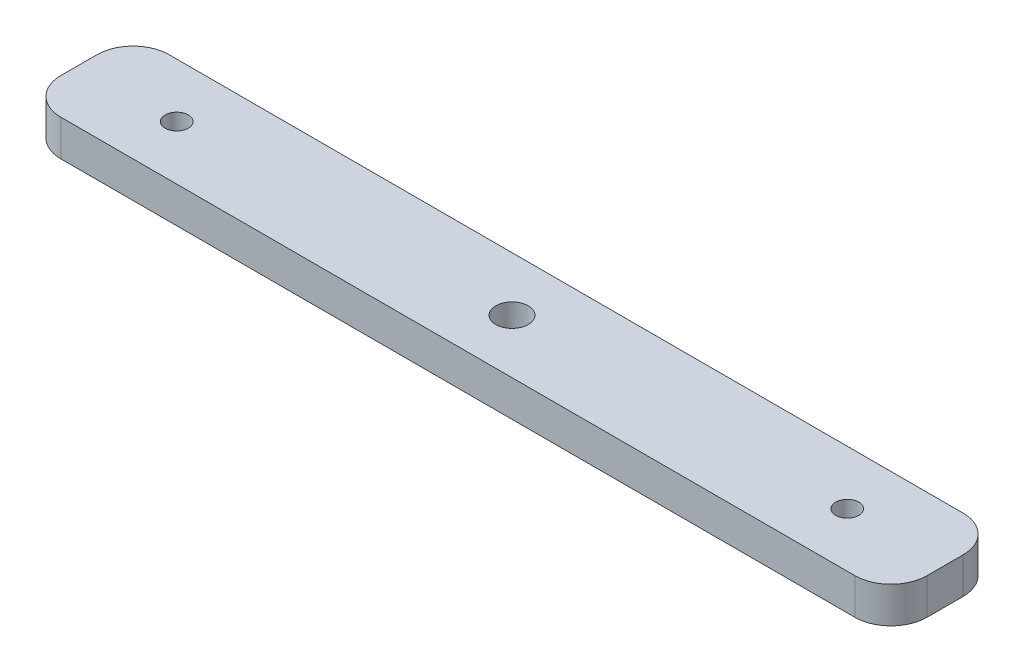
ISO-10303-21;
HEADER;
FILE_DESCRIPTION(('STEP AP214'),'2;1');
FILE_NAME('part.step','',(''),(''),'','','');
FILE_SCHEMA(('AUTOMOTIVE_DESIGN { 1 0 10303 214 1 1 1 1 }'));
ENDSEC;
DATA;
#1=APPLICATION_CONTEXT('core data for automotive mechanical design processes');
#2=APPLICATION_PROTOCOL_DEFINITION('international standard','automotive_design',2000,#1);
#3=PRODUCT_CONTEXT('',#1,'mechanical');
#4=PRODUCT('Part','Part','',(#3));
#5=PRODUCT_RELATED_PRODUCT_CATEGORY('part','',(#4));
#6=PRODUCT_DEFINITION_FORMATION('','',#4);
#7=PRODUCT_DEFINITION_CONTEXT('part definition',#1,'design');
#8=PRODUCT_DEFINITION('design','',#6,#7);
#9=PRODUCT_DEFINITION_SHAPE('','',#8);
#10=(LENGTH_UNIT() NAMED_UNIT(*) SI_UNIT(.MILLI.,.METRE.));
#11=(NAMED_UNIT(*) PLANE_ANGLE_UNIT() SI_UNIT($,.RADIAN.));
#12=(NAMED_UNIT(*) SI_UNIT($,.STERADIAN.) SOLID_ANGLE_UNIT());
#13=UNCERTAINTY_MEASURE_WITH_UNIT(LENGTH_MEASURE(1.E-05),#10,'distance_accuracy_value','');
#14=(GEOMETRIC_REPRESENTATION_CONTEXT(3) GLOBAL_UNCERTAINTY_ASSIGNED_CONTEXT((#13)) GLOBAL_UNIT_ASSIGNED_CONTEXT((#10,
#11,#12)) REPRESENTATION_CONTEXT('',''));
#15=CARTESIAN_POINT('',(0.,0.,0.));
#16=DIRECTION('',(0.,0.,1.));
#17=DIRECTION('',(1.,0.,0.));
#18=AXIS2_PLACEMENT_3D('',#15,#16,#17);
#19=CARTESIAN_POINT('',(0.,5.,0.));
#20=DIRECTION('',(1.,0.,0.));
#21=DIRECTION('',(0.,0.,-1.));
#22=AXIS2_PLACEMENT_3D('',#19,#20,#21);
#23=PLANE('',#22);
#24=DIRECTION('',(0.,0.,1.));
#25=VECTOR('',#24,1.);
#26=CARTESIAN_POINT('',(0.,5.,0.));
#27=LINE('',#26,#25);
#28=CARTESIAN_POINT('',(0.,5.,-10.));
#29=VERTEX_POINT('',#28);
#30=CARTESIAN_POINT('',(0.,5.,-5.));
#31=VERTEX_POINT('',#30);
#32=EDGE_CURVE('E120',#29,#31,#27,.T.);
#33=ORIENTED_EDGE('',*,*,#32,.F.);
#34=DIRECTION('',(0.,-1.,0.));
#35=VECTOR('',#34,1.);
#36=CARTESIAN_POINT('',(0.,5.,-10.));
#37=LINE('',#36,#35);
#38=CARTESIAN_POINT('',(0.,0.,-10.));
#39=VERTEX_POINT('',#38);
#40=EDGE_CURVE('E105',#29,#39,#37,.T.);
#41=ORIENTED_EDGE('',*,*,#40,.T.);
#42=DIRECTION('',(0.,0.,1.));
#43=VECTOR('',#42,1.);
#44=CARTESIAN_POINT('',(0.,0.,0.));
#45=LINE('',#44,#43);
#46=CARTESIAN_POINT('',(0.,0.,-5.));
#47=VERTEX_POINT('',#46);
#48=EDGE_CURVE('E117',#39,#47,#45,.T.);
#49=ORIENTED_EDGE('',*,*,#48,.T.);
#50=DIRECTION('',(0.,-1.,0.));
#51=VECTOR('',#50,1.);
#52=CARTESIAN_POINT('',(0.,5.,-5.));
#53=LINE('',#52,#51);
#54=EDGE_CURVE('E122',#47,#31,#53,.F.);
#55=ORIENTED_EDGE('',*,*,#54,.T.);
#56=EDGE_LOOP('',(#33,#41,#49,#55));
#57=FACE_BOUND('',#56,.T.);
#58=ADVANCED_FACE('F36',(#57),#23,.F.);
#59=CARTESIAN_POINT('',(0.,5.,0.));
#60=DIRECTION('',(0.,0.,-1.));
#61=DIRECTION('',(-1.,0.,0.));
#62=AXIS2_PLACEMENT_3D('',#59,#60,#61);
#63=PLANE('',#62);
#64=DIRECTION('',(1.,0.,0.));
#65=VECTOR('',#64,1.);
#66=CARTESIAN_POINT('',(0.,5.,0.));
#67=LINE('',#66,#65);
#68=CARTESIAN_POINT('',(5.,5.,0.));
#69=VERTEX_POINT('',#68);
#70=CARTESIAN_POINT('',(115.,5.,0.));
#71=VERTEX_POINT('',#70);
#72=EDGE_CURVE('E175',#69,#71,#67,.T.);
#73=ORIENTED_EDGE('',*,*,#72,.F.);
#74=DIRECTION('',(0.,-1.,0.));
#75=VECTOR('',#74,1.);
#76=CARTESIAN_POINT('',(5.,5.,0.));
#77=LINE('',#76,#75);
#78=CARTESIAN_POINT('',(5.,0.,0.));
#79=VERTEX_POINT('',#78);
#80=EDGE_CURVE('E159',#69,#79,#77,.T.);
#81=ORIENTED_EDGE('',*,*,#80,.T.);
#82=DIRECTION('',(1.,0.,0.));
#83=VECTOR('',#82,1.);
#84=CARTESIAN_POINT('',(0.,0.,0.));
#85=LINE('',#84,#83);
#86=CARTESIAN_POINT('',(115.,0.,0.));
#87=VERTEX_POINT('',#86);
#88=EDGE_CURVE('E126',#79,#87,#85,.T.);
#89=ORIENTED_EDGE('',*,*,#88,.T.);
#90=DIRECTION('',(0.,-1.,0.));
#91=VECTOR('',#90,1.);
#92=CARTESIAN_POINT('',(115.,5.,0.));
#93=LINE('',#92,#91);
#94=EDGE_CURVE('E157',#87,#71,#93,.F.);
#95=ORIENTED_EDGE('',*,*,#94,.T.);
#96=EDGE_LOOP('',(#73,#81,#89,#95));
#97=FACE_BOUND('',#96,.T.);
#98=ADVANCED_FACE('F224',(#97),#63,.F.);
#99=CARTESIAN_POINT('',(120.,5.,0.));
#100=DIRECTION('',(-1.,0.,0.));
#101=DIRECTION('',(0.,0.,1.));
#102=AXIS2_PLACEMENT_3D('',#99,#100,#101);
#103=PLANE('',#102);
#104=DIRECTION('',(0.,0.,-1.));
#105=VECTOR('',#104,1.);
#106=CARTESIAN_POINT('',(120.,0.,0.));
#107=LINE('',#106,#105);
#108=CARTESIAN_POINT('',(120.,0.,-5.));
#109=VERTEX_POINT('',#108);
#110=CARTESIAN_POINT('',(120.,0.,-10.));
#111=VERTEX_POINT('',#110);
#112=EDGE_CURVE('E130',#109,#111,#107,.T.);
#113=ORIENTED_EDGE('',*,*,#112,.T.);
#114=DIRECTION('',(0.,-1.,0.));
#115=VECTOR('',#114,1.);
#116=CARTESIAN_POINT('',(120.,5.,-10.));
#117=LINE('',#116,#115);
#118=CARTESIAN_POINT('',(120.,5.,-10.));
#119=VERTEX_POINT('',#118);
#120=EDGE_CURVE('E11',#111,#119,#117,.F.);
#121=ORIENTED_EDGE('',*,*,#120,.T.);
#122=DIRECTION('',(0.,0.,-1.));
#123=VECTOR('',#122,1.);
#124=CARTESIAN_POINT('',(120.,5.,0.));
#125=LINE('',#124,#123);
#126=CARTESIAN_POINT('',(120.,5.,-5.));
#127=VERTEX_POINT('',#126);
#128=EDGE_CURVE('E165',#127,#119,#125,.T.);
#129=ORIENTED_EDGE('',*,*,#128,.F.);
#130=DIRECTION('',(0.,-1.,0.));
#131=VECTOR('',#130,1.);
#132=CARTESIAN_POINT('',(120.,5.,-5.));
#133=LINE('',#132,#131);
#134=EDGE_CURVE('E44',#127,#109,#133,.T.);
#135=ORIENTED_EDGE('',*,*,#134,.T.);
#136=EDGE_LOOP('',(#113,#121,#129,#135));
#137=FACE_BOUND('',#136,.T.);
#138=ADVANCED_FACE('F164',(#137),#103,.F.);
#139=CARTESIAN_POINT('',(0.,5.,-15.));
#140=DIRECTION('',(0.,0.,1.));
#141=DIRECTION('',(1.,0.,0.));
#142=AXIS2_PLACEMENT_3D('',#139,#140,#141);
#143=PLANE('',#142);
#144=DIRECTION('',(-1.,0.,0.));
#145=VECTOR('',#144,1.);
#146=CARTESIAN_POINT('',(0.,0.,-15.));
#147=LINE('',#146,#145);
#148=CARTESIAN_POINT('',(115.,0.,-15.));
#149=VERTEX_POINT('',#148);
#150=CARTESIAN_POINT('',(5.,0.,-15.));
#151=VERTEX_POINT('',#150);
#152=EDGE_CURVE('E140',#149,#151,#147,.T.);
#153=ORIENTED_EDGE('',*,*,#152,.T.);
#154=DIRECTION('',(0.,-1.,0.));
#155=VECTOR('',#154,1.);
#156=CARTESIAN_POINT('',(5.,5.,-15.));
#157=LINE('',#156,#155);
#158=CARTESIAN_POINT('',(5.,5.,-15.));
#159=VERTEX_POINT('',#158);
#160=EDGE_CURVE('E106',#151,#159,#157,.F.);
#161=ORIENTED_EDGE('',*,*,#160,.T.);
#162=DIRECTION('',(-1.,0.,0.));
#163=VECTOR('',#162,1.);
#164=CARTESIAN_POINT('',(0.,5.,-15.));
#165=LINE('',#164,#163);
#166=CARTESIAN_POINT('',(115.,5.,-15.));
#167=VERTEX_POINT('',#166);
#168=EDGE_CURVE('E136',#167,#159,#165,.T.);
#169=ORIENTED_EDGE('',*,*,#168,.F.);
#170=DIRECTION('',(0.,-1.,0.));
#171=VECTOR('',#170,1.);
#172=CARTESIAN_POINT('',(115.,5.,-15.));
#173=LINE('',#172,#171);
#174=EDGE_CURVE('E111',#167,#149,#173,.T.);
#175=ORIENTED_EDGE('',*,*,#174,.T.);
#176=EDGE_LOOP('',(#153,#161,#169,#175));
#177=FACE_BOUND('',#176,.T.);
#178=ADVANCED_FACE('F173',(#177),#143,.F.);
#179=CARTESIAN_POINT('',(0.,5.,0.));
#180=DIRECTION('',(0.,-1.,0.));
#181=DIRECTION('',(0.,0.,-1.));
#182=AXIS2_PLACEMENT_3D('',#179,#180,#181);
#183=PLANE('',#182);
#184=CARTESIAN_POINT('',(60.,5.,-7.5));
#185=DIRECTION('',(0.,1.,0.));
#186=DIRECTION('',(0.,0.,1.));
#187=AXIS2_PLACEMENT_3D('',#184,#185,#186);
#188=CIRCLE('',#187,2.25);
#189=CARTESIAN_POINT('',(60.,5.,-5.25));
#190=VERTEX_POINT('',#189);
#191=EDGE_CURVE('E188',#190,#190,#188,.T.);
#192=ORIENTED_EDGE('',*,*,#191,.F.);
#193=EDGE_LOOP('',(#192));
#194=FACE_BOUND('',#193,.T.);
#195=CARTESIAN_POINT('',(106.45,5.,-7.50000000000002));
#196=DIRECTION('',(0.,1.,0.));
#197=DIRECTION('',(0.,0.,1.));
#198=AXIS2_PLACEMENT_3D('',#195,#196,#197);
#199=CIRCLE('',#198,1.6);
#200=CARTESIAN_POINT('',(106.45,5.,-5.90000000000001));
#201=VERTEX_POINT('',#200);
#202=EDGE_CURVE('E182',#201,#201,#199,.T.);
#203=ORIENTED_EDGE('',*,*,#202,.F.);
#204=EDGE_LOOP('',(#203));
#205=FACE_BOUND('',#204,.T.);
#206=CARTESIAN_POINT('',(13.55,5.,-7.5));
#207=DIRECTION('',(0.,1.,0.));
#208=DIRECTION('',(0.,0.,1.));
#209=AXIS2_PLACEMENT_3D('',#206,#207,#208);
#210=CIRCLE('',#209,1.6);
#211=CARTESIAN_POINT('',(13.55,5.,-5.9));
#212=VERTEX_POINT('',#211);
#213=EDGE_CURVE('E133',#212,#212,#210,.T.);
#214=ORIENTED_EDGE('',*,*,#213,.F.);
#215=EDGE_LOOP('',(#214));
#216=FACE_BOUND('',#215,.T.);
#217=ORIENTED_EDGE('',*,*,#168,.T.);
#218=CARTESIAN_POINT('',(5.,5.,-10.));
#219=DIRECTION('',(0.,-1.,0.));
#220=DIRECTION('',(0.,0.,-1.));
#221=AXIS2_PLACEMENT_3D('',#218,#219,#220);
#222=CIRCLE('',#221,5.);
#223=EDGE_CURVE('E155',#159,#29,#222,.F.);
#224=ORIENTED_EDGE('',*,*,#223,.T.);
#225=ORIENTED_EDGE('',*,*,#32,.T.);
#226=CARTESIAN_POINT('',(5.,5.,-5.));
#227=DIRECTION('',(0.,-1.,0.));
#228=DIRECTION('',(0.,0.,-1.));
#229=AXIS2_PLACEMENT_3D('',#226,#227,#228);
#230=CIRCLE('',#229,5.);
#231=EDGE_CURVE('E153',#31,#69,#230,.F.);
#232=ORIENTED_EDGE('',*,*,#231,.T.);
#233=ORIENTED_EDGE('',*,*,#72,.T.);
#234=CARTESIAN_POINT('',(115.,5.,-5.));
#235=DIRECTION('',(0.,-1.,0.));
#236=DIRECTION('',(0.,0.,-1.));
#237=AXIS2_PLACEMENT_3D('',#234,#235,#236);
#238=CIRCLE('',#237,5.);
#239=EDGE_CURVE('E56',#71,#127,#238,.F.);
#240=ORIENTED_EDGE('',*,*,#239,.T.);
#241=ORIENTED_EDGE('',*,*,#128,.T.);
#242=CARTESIAN_POINT('',(115.,5.,-10.));
#243=DIRECTION('',(0.,-1.,0.));
#244=DIRECTION('',(0.,0.,-1.));
#245=AXIS2_PLACEMENT_3D('',#242,#243,#244);
#246=CIRCLE('',#245,5.);
#247=EDGE_CURVE('E151',#119,#167,#246,.F.);
#248=ORIENTED_EDGE('',*,*,#247,.T.);
#249=EDGE_LOOP('',(#217,#224,#225,#232,#233,#240,#241,#248));
#250=FACE_BOUND('',#249,.T.);
#251=ADVANCED_FACE('F203',(#194,#205,#216,#250),#183,.F.);
#252=CARTESIAN_POINT('',(0.,0.,0.));
#253=DIRECTION('',(0.,-1.,0.));
#254=DIRECTION('',(0.,0.,-1.));
#255=AXIS2_PLACEMENT_3D('',#252,#253,#254);
#256=PLANE('',#255);
#257=CARTESIAN_POINT('',(60.,0.,-7.5));
#258=DIRECTION('',(0.,1.,0.));
#259=DIRECTION('',(0.,0.,1.));
#260=AXIS2_PLACEMENT_3D('',#257,#258,#259);
#261=CIRCLE('',#260,2.25);
#262=CARTESIAN_POINT('',(60.,0.,-5.25));
#263=VERTEX_POINT('',#262);
#264=EDGE_CURVE('E185',#263,#263,#261,.T.);
#265=ORIENTED_EDGE('',*,*,#264,.T.);
#266=EDGE_LOOP('',(#265));
#267=FACE_BOUND('',#266,.T.);
#268=CARTESIAN_POINT('',(106.45,0.,-7.50000000000002));
#269=DIRECTION('',(0.,1.,0.));
#270=DIRECTION('',(0.,0.,1.));
#271=AXIS2_PLACEMENT_3D('',#268,#269,#270);
#272=CIRCLE('',#271,1.6);
#273=CARTESIAN_POINT('',(106.45,0.,-5.90000000000001));
#274=VERTEX_POINT('',#273);
#275=EDGE_CURVE('E180',#274,#274,#272,.T.);
#276=ORIENTED_EDGE('',*,*,#275,.T.);
#277=EDGE_LOOP('',(#276));
#278=FACE_BOUND('',#277,.T.);
#279=CARTESIAN_POINT('',(13.55,0.,-7.5));
#280=DIRECTION('',(0.,1.,0.));
#281=DIRECTION('',(0.,0.,1.));
#282=AXIS2_PLACEMENT_3D('',#279,#280,#281);
#283=CIRCLE('',#282,1.6);
#284=CARTESIAN_POINT('',(13.55,0.,-5.9));
#285=VERTEX_POINT('',#284);
#286=EDGE_CURVE('E127',#285,#285,#283,.T.);
#287=ORIENTED_EDGE('',*,*,#286,.T.);
#288=EDGE_LOOP('',(#287));
#289=FACE_BOUND('',#288,.T.);
#290=ORIENTED_EDGE('',*,*,#48,.F.);
#291=CARTESIAN_POINT('',(5.,0.,-10.));
#292=DIRECTION('',(0.,-1.,0.));
#293=DIRECTION('',(0.,0.,-1.));
#294=AXIS2_PLACEMENT_3D('',#291,#292,#293);
#295=CIRCLE('',#294,5.);
#296=EDGE_CURVE('E101',#39,#151,#295,.T.);
#297=ORIENTED_EDGE('',*,*,#296,.T.);
#298=ORIENTED_EDGE('',*,*,#152,.F.);
#299=CARTESIAN_POINT('',(115.,0.,-10.));
#300=DIRECTION('',(0.,-1.,0.));
#301=DIRECTION('',(0.,0.,-1.));
#302=AXIS2_PLACEMENT_3D('',#299,#300,#301);
#303=CIRCLE('',#302,5.);
#304=EDGE_CURVE('E144',#149,#111,#303,.T.);
#305=ORIENTED_EDGE('',*,*,#304,.T.);
#306=ORIENTED_EDGE('',*,*,#112,.F.);
#307=CARTESIAN_POINT('',(115.,0.,-5.));
#308=DIRECTION('',(0.,-1.,0.));
#309=DIRECTION('',(0.,0.,-1.));
#310=AXIS2_PLACEMENT_3D('',#307,#308,#309);
#311=CIRCLE('',#310,5.);
#312=EDGE_CURVE('E121',#109,#87,#311,.T.);
#313=ORIENTED_EDGE('',*,*,#312,.T.);
#314=ORIENTED_EDGE('',*,*,#88,.F.);
#315=CARTESIAN_POINT('',(5.,0.,-5.));
#316=DIRECTION('',(0.,-1.,0.));
#317=DIRECTION('',(0.,0.,-1.));
#318=AXIS2_PLACEMENT_3D('',#315,#316,#317);
#319=CIRCLE('',#318,5.);
#320=EDGE_CURVE('E112',#79,#47,#319,.T.);
#321=ORIENTED_EDGE('',*,*,#320,.T.);
#322=EDGE_LOOP('',(#290,#297,#298,#305,#306,#313,#314,#321));
#323=FACE_BOUND('',#322,.T.);
#324=ADVANCED_FACE('F124',(#267,#278,#289,#323),#256,.T.);
#325=CARTESIAN_POINT('',(13.55,0.,-7.5));
#326=DIRECTION('',(0.,1.,0.));
#327=DIRECTION('',(0.,0.,1.));
#328=AXIS2_PLACEMENT_3D('',#325,#326,#327);
#329=CYLINDRICAL_SURFACE('',#328,1.6);
#330=ORIENTED_EDGE('',*,*,#286,.F.);
#331=EDGE_LOOP('',(#330));
#332=FACE_BOUND('',#331,.T.);
#333=ORIENTED_EDGE('',*,*,#213,.T.);
#334=EDGE_LOOP('',(#333));
#335=FACE_BOUND('',#334,.T.);
#336=ADVANCED_FACE('F211',(#332,#335),#329,.F.);
#337=CARTESIAN_POINT('',(106.45,0.,-7.50000000000002));
#338=DIRECTION('',(0.,1.,0.));
#339=DIRECTION('',(0.,0.,1.));
#340=AXIS2_PLACEMENT_3D('',#337,#338,#339);
#341=CYLINDRICAL_SURFACE('',#340,1.6);
#342=ORIENTED_EDGE('',*,*,#275,.F.);
#343=EDGE_LOOP('',(#342));
#344=FACE_BOUND('',#343,.T.);
#345=ORIENTED_EDGE('',*,*,#202,.T.);
#346=EDGE_LOOP('',(#345));
#347=FACE_BOUND('',#346,.T.);
#348=ADVANCED_FACE('F199',(#344,#347),#341,.F.);
#349=CARTESIAN_POINT('',(60.,0.,-7.5));
#350=DIRECTION('',(0.,1.,0.));
#351=DIRECTION('',(0.,0.,1.));
#352=AXIS2_PLACEMENT_3D('',#349,#350,#351);
#353=CYLINDRICAL_SURFACE('',#352,2.25);
#354=ORIENTED_EDGE('',*,*,#264,.F.);
#355=EDGE_LOOP('',(#354));
#356=FACE_BOUND('',#355,.T.);
#357=ORIENTED_EDGE('',*,*,#191,.T.);
#358=EDGE_LOOP('',(#357));
#359=FACE_BOUND('',#358,.T.);
#360=ADVANCED_FACE('F196',(#356,#359),#353,.F.);
#361=CARTESIAN_POINT('',(5.,5.,-10.));
#362=DIRECTION('',(0.,-1.,0.));
#363=DIRECTION('',(0.,0.,-1.));
#364=AXIS2_PLACEMENT_3D('',#361,#362,#363);
#365=CYLINDRICAL_SURFACE('',#364,5.);
#366=ORIENTED_EDGE('',*,*,#223,.F.);
#367=ORIENTED_EDGE('',*,*,#160,.F.);
#368=ORIENTED_EDGE('',*,*,#296,.F.);
#369=ORIENTED_EDGE('',*,*,#40,.F.);
#370=EDGE_LOOP('',(#366,#367,#368,#369));
#371=FACE_BOUND('',#370,.T.);
#372=ADVANCED_FACE('F104',(#371),#365,.T.);
#373=CARTESIAN_POINT('',(5.,5.,-5.));
#374=DIRECTION('',(0.,-1.,0.));
#375=DIRECTION('',(0.,0.,-1.));
#376=AXIS2_PLACEMENT_3D('',#373,#374,#375);
#377=CYLINDRICAL_SURFACE('',#376,5.);
#378=ORIENTED_EDGE('',*,*,#231,.F.);
#379=ORIENTED_EDGE('',*,*,#54,.F.);
#380=ORIENTED_EDGE('',*,*,#320,.F.);
#381=ORIENTED_EDGE('',*,*,#80,.F.);
#382=EDGE_LOOP('',(#378,#379,#380,#381));
#383=FACE_BOUND('',#382,.T.);
#384=ADVANCED_FACE('F235',(#383),#377,.T.);
#385=CARTESIAN_POINT('',(115.,5.,-10.));
#386=DIRECTION('',(0.,-1.,0.));
#387=DIRECTION('',(0.,0.,-1.));
#388=AXIS2_PLACEMENT_3D('',#385,#386,#387);
#389=CYLINDRICAL_SURFACE('',#388,5.);
#390=ORIENTED_EDGE('',*,*,#247,.F.);
#391=ORIENTED_EDGE('',*,*,#120,.F.);
#392=ORIENTED_EDGE('',*,*,#304,.F.);
#393=ORIENTED_EDGE('',*,*,#174,.F.);
#394=EDGE_LOOP('',(#390,#391,#392,#393));
#395=FACE_BOUND('',#394,.T.);
#396=ADVANCED_FACE('F170',(#395),#389,.T.);
#397=CARTESIAN_POINT('',(115.,5.,-5.));
#398=DIRECTION('',(0.,-1.,0.));
#399=DIRECTION('',(0.,0.,-1.));
#400=AXIS2_PLACEMENT_3D('',#397,#398,#399);
#401=CYLINDRICAL_SURFACE('',#400,5.);
#402=ORIENTED_EDGE('',*,*,#239,.F.);
#403=ORIENTED_EDGE('',*,*,#94,.F.);
#404=ORIENTED_EDGE('',*,*,#312,.F.);
#405=ORIENTED_EDGE('',*,*,#134,.F.);
#406=EDGE_LOOP('',(#402,#403,#404,#405));
#407=FACE_BOUND('',#406,.T.);
#408=ADVANCED_FACE('F38',(#407),#401,.T.);
#409=CLOSED_SHELL('',(#58,#98,#138,#178,#251,#324,#336,#348,#360,#372,#384,#396,#408));
#410=MANIFOLD_SOLID_BREP('B2',#409);
#411=ADVANCED_BREP_SHAPE_REPRESENTATION('',(#18,#410),#14);
#412=SHAPE_DEFINITION_REPRESENTATION(#9,#411);
ENDSEC;
END-ISO-10303-21;
